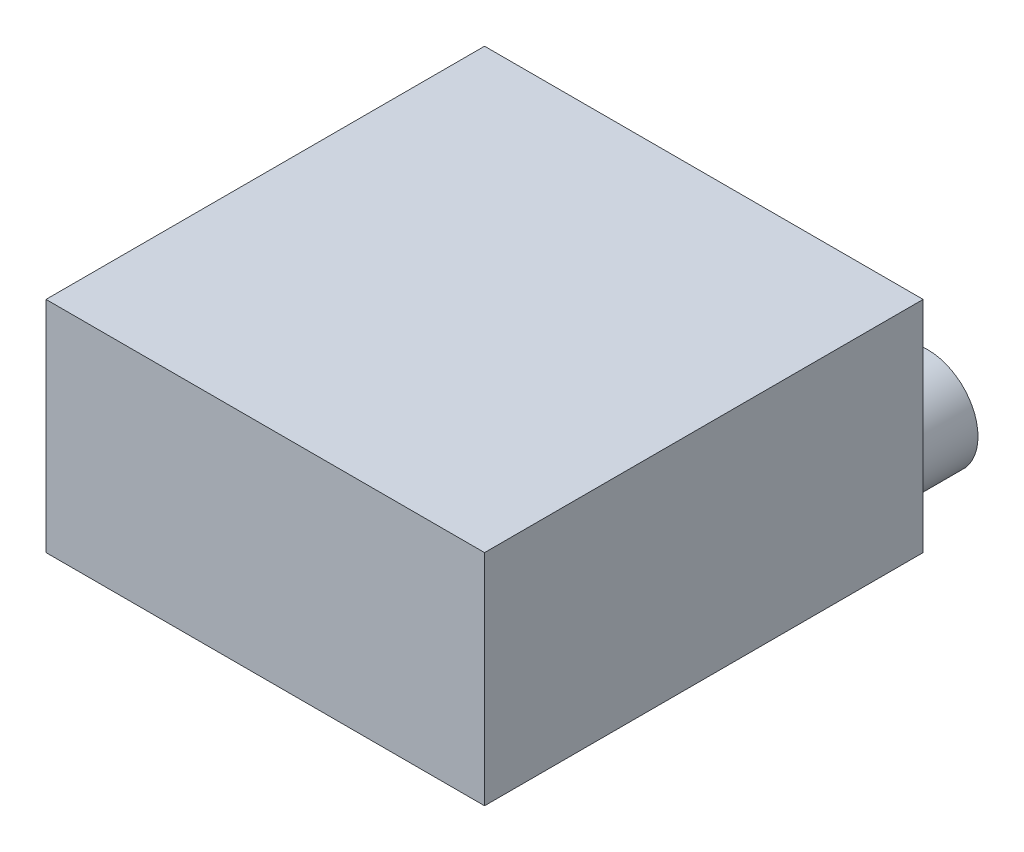
ISO-10303-21;
HEADER;
FILE_DESCRIPTION(('STEP AP214'),'2;1');
FILE_NAME('part.step','',(''),(''),'','','');
FILE_SCHEMA(('AUTOMOTIVE_DESIGN { 1 0 10303 214 1 1 1 1 }'));
ENDSEC;
DATA;
#1=APPLICATION_CONTEXT('core data for automotive mechanical design processes');
#2=APPLICATION_PROTOCOL_DEFINITION('international standard','automotive_design',2000,#1);
#3=PRODUCT_CONTEXT('',#1,'mechanical');
#4=PRODUCT('Part','Part','',(#3));
#5=PRODUCT_RELATED_PRODUCT_CATEGORY('part','',(#4));
#6=PRODUCT_DEFINITION_FORMATION('','',#4);
#7=PRODUCT_DEFINITION_CONTEXT('part definition',#1,'design');
#8=PRODUCT_DEFINITION('design','',#6,#7);
#9=PRODUCT_DEFINITION_SHAPE('','',#8);
#10=(LENGTH_UNIT() NAMED_UNIT(*) SI_UNIT(.MILLI.,.METRE.));
#11=(NAMED_UNIT(*) PLANE_ANGLE_UNIT() SI_UNIT($,.RADIAN.));
#12=(NAMED_UNIT(*) SI_UNIT($,.STERADIAN.) SOLID_ANGLE_UNIT());
#13=UNCERTAINTY_MEASURE_WITH_UNIT(LENGTH_MEASURE(1.E-05),#10,'distance_accuracy_value','');
#14=(GEOMETRIC_REPRESENTATION_CONTEXT(3) GLOBAL_UNCERTAINTY_ASSIGNED_CONTEXT((#13)) GLOBAL_UNIT_ASSIGNED_CONTEXT((#10,
#11,#12)) REPRESENTATION_CONTEXT('',''));
#15=CARTESIAN_POINT('',(0.,0.,0.));
#16=DIRECTION('',(0.,0.,1.));
#17=DIRECTION('',(1.,0.,0.));
#18=AXIS2_PLACEMENT_3D('',#15,#16,#17);
#19=CARTESIAN_POINT('',(-4.69849246231156,5.,-0.653266331658294));
#20=DIRECTION('',(1.,0.,0.));
#21=DIRECTION('',(0.,0.,-1.));
#22=AXIS2_PLACEMENT_3D('',#19,#20,#21);
#23=PLANE('',#22);
#24=DIRECTION('',(0.,0.,1.));
#25=VECTOR('',#24,1.);
#26=CARTESIAN_POINT('',(-4.69849246231156,0.,-0.653266331658294));
#27=LINE('',#26,#25);
#28=CARTESIAN_POINT('',(-4.69849246231156,0.,-0.653266331658294));
#29=VERTEX_POINT('',#28);
#30=CARTESIAN_POINT('',(-4.69849246231155,0.,9.34673366834171));
#31=VERTEX_POINT('',#30);
#32=EDGE_CURVE('E99',#29,#31,#27,.T.);
#33=ORIENTED_EDGE('',*,*,#32,.T.);
#34=DIRECTION('',(0.,-1.,0.));
#35=VECTOR('',#34,1.);
#36=CARTESIAN_POINT('',(-4.69849246231155,5.,9.34673366834171));
#37=LINE('',#36,#35);
#38=CARTESIAN_POINT('',(-4.69849246231155,5.,9.34673366834171));
#39=VERTEX_POINT('',#38);
#40=EDGE_CURVE('E41',#39,#31,#37,.T.);
#41=ORIENTED_EDGE('',*,*,#40,.F.);
#42=DIRECTION('',(0.,0.,1.));
#43=VECTOR('',#42,1.);
#44=CARTESIAN_POINT('',(-4.69849246231156,5.,-0.653266331658294));
#45=LINE('',#44,#43);
#46=CARTESIAN_POINT('',(-4.69849246231156,5.,-0.653266331658294));
#47=VERTEX_POINT('',#46);
#48=EDGE_CURVE('E85',#47,#39,#45,.T.);
#49=ORIENTED_EDGE('',*,*,#48,.F.);
#50=DIRECTION('',(0.,-1.,0.));
#51=VECTOR('',#50,1.);
#52=CARTESIAN_POINT('',(-4.69849246231156,5.,-0.653266331658294));
#53=LINE('',#52,#51);
#54=EDGE_CURVE('E95',#47,#29,#53,.T.);
#55=ORIENTED_EDGE('',*,*,#54,.T.);
#56=EDGE_LOOP('',(#33,#41,#49,#55));
#57=FACE_BOUND('',#56,.T.);
#58=ADVANCED_FACE('F33',(#57),#23,.F.);
#59=CARTESIAN_POINT('',(-4.69849246231155,5.,9.34673366834171));
#60=DIRECTION('',(0.,0.,-1.));
#61=DIRECTION('',(-1.,0.,0.));
#62=AXIS2_PLACEMENT_3D('',#59,#60,#61);
#63=PLANE('',#62);
#64=DIRECTION('',(1.,0.,0.));
#65=VECTOR('',#64,1.);
#66=CARTESIAN_POINT('',(-4.69849246231155,0.,9.34673366834171));
#67=LINE('',#66,#65);
#68=CARTESIAN_POINT('',(5.30150753768844,0.,9.34673366834171));
#69=VERTEX_POINT('',#68);
#70=EDGE_CURVE('E90',#31,#69,#67,.T.);
#71=ORIENTED_EDGE('',*,*,#70,.T.);
#72=DIRECTION('',(0.,-1.,0.));
#73=VECTOR('',#72,1.);
#74=CARTESIAN_POINT('',(5.30150753768844,5.,9.34673366834171));
#75=LINE('',#74,#73);
#76=CARTESIAN_POINT('',(5.30150753768844,5.,9.34673366834171));
#77=VERTEX_POINT('',#76);
#78=EDGE_CURVE('E88',#77,#69,#75,.T.);
#79=ORIENTED_EDGE('',*,*,#78,.F.);
#80=DIRECTION('',(1.,0.,0.));
#81=VECTOR('',#80,1.);
#82=CARTESIAN_POINT('',(-4.69849246231155,5.,9.34673366834171));
#83=LINE('',#82,#81);
#84=EDGE_CURVE('E80',#39,#77,#83,.T.);
#85=ORIENTED_EDGE('',*,*,#84,.F.);
#86=ORIENTED_EDGE('',*,*,#40,.T.);
#87=EDGE_LOOP('',(#71,#79,#85,#86));
#88=FACE_BOUND('',#87,.T.);
#89=ADVANCED_FACE('F89',(#88),#63,.F.);
#90=CARTESIAN_POINT('',(5.30150753768844,5.,-0.653266331658294));
#91=DIRECTION('',(-1.,0.,0.));
#92=DIRECTION('',(0.,0.,1.));
#93=AXIS2_PLACEMENT_3D('',#90,#91,#92);
#94=PLANE('',#93);
#95=DIRECTION('',(0.,0.,-1.));
#96=VECTOR('',#95,1.);
#97=CARTESIAN_POINT('',(5.30150753768844,0.,-0.653266331658294));
#98=LINE('',#97,#96);
#99=CARTESIAN_POINT('',(5.30150753768844,0.,-0.653266331658294));
#100=VERTEX_POINT('',#99);
#101=EDGE_CURVE('E66',#69,#100,#98,.T.);
#102=ORIENTED_EDGE('',*,*,#101,.T.);
#103=DIRECTION('',(0.,-1.,0.));
#104=VECTOR('',#103,1.);
#105=CARTESIAN_POINT('',(5.30150753768844,5.,-0.653266331658294));
#106=LINE('',#105,#104);
#107=CARTESIAN_POINT('',(5.30150753768844,5.,-0.653266331658294));
#108=VERTEX_POINT('',#107);
#109=EDGE_CURVE('E91',#108,#100,#106,.T.);
#110=ORIENTED_EDGE('',*,*,#109,.F.);
#111=DIRECTION('',(0.,0.,-1.));
#112=VECTOR('',#111,1.);
#113=CARTESIAN_POINT('',(5.30150753768844,5.,-0.653266331658294));
#114=LINE('',#113,#112);
#115=EDGE_CURVE('E83',#77,#108,#114,.T.);
#116=ORIENTED_EDGE('',*,*,#115,.F.);
#117=ORIENTED_EDGE('',*,*,#78,.T.);
#118=EDGE_LOOP('',(#102,#110,#116,#117));
#119=FACE_BOUND('',#118,.T.);
#120=ADVANCED_FACE('F93',(#119),#94,.F.);
#121=CARTESIAN_POINT('',(-4.69849246231156,5.,-0.653266331658294));
#122=DIRECTION('',(0.,0.,1.));
#123=DIRECTION('',(1.,0.,0.));
#124=AXIS2_PLACEMENT_3D('',#121,#122,#123);
#125=PLANE('',#124);
#126=CARTESIAN_POINT('',(3.90937804929714,1.41640749139401,-0.653266331658294));
#127=DIRECTION('',(0.,0.,1.));
#128=DIRECTION('',(1.,0.,0.));
#129=AXIS2_PLACEMENT_3D('',#126,#127,#128);
#130=CIRCLE('',#129,1.14344508698068);
#131=CARTESIAN_POINT('',(5.05282313627782,1.41640749139401,-0.653266331658294));
#132=VERTEX_POINT('',#131);
#133=EDGE_CURVE('E11',#132,#132,#130,.F.);
#134=ORIENTED_EDGE('',*,*,#133,.F.);
#135=EDGE_LOOP('',(#134));
#136=FACE_BOUND('',#135,.T.);
#137=DIRECTION('',(-1.,0.,0.));
#138=VECTOR('',#137,1.);
#139=CARTESIAN_POINT('',(-4.69849246231156,0.,-0.653266331658294));
#140=LINE('',#139,#138);
#141=EDGE_CURVE('E72',#100,#29,#140,.T.);
#142=ORIENTED_EDGE('',*,*,#141,.T.);
#143=ORIENTED_EDGE('',*,*,#54,.F.);
#144=DIRECTION('',(-1.,0.,0.));
#145=VECTOR('',#144,1.);
#146=CARTESIAN_POINT('',(-4.69849246231156,5.,-0.653266331658294));
#147=LINE('',#146,#145);
#148=EDGE_CURVE('E49',#108,#47,#147,.T.);
#149=ORIENTED_EDGE('',*,*,#148,.F.);
#150=ORIENTED_EDGE('',*,*,#109,.T.);
#151=EDGE_LOOP('',(#142,#143,#149,#150));
#152=FACE_BOUND('',#151,.T.);
#153=ADVANCED_FACE('F121',(#136,#152),#125,.F.);
#154=CARTESIAN_POINT('',(0.,5.,0.));
#155=DIRECTION('',(0.,1.,0.));
#156=DIRECTION('',(0.,0.,1.));
#157=AXIS2_PLACEMENT_3D('',#154,#155,#156);
#158=PLANE('',#157);
#159=ORIENTED_EDGE('',*,*,#48,.T.);
#160=ORIENTED_EDGE('',*,*,#84,.T.);
#161=ORIENTED_EDGE('',*,*,#115,.T.);
#162=ORIENTED_EDGE('',*,*,#148,.T.);
#163=EDGE_LOOP('',(#159,#160,#161,#162));
#164=FACE_BOUND('',#163,.T.);
#165=ADVANCED_FACE('F81',(#164),#158,.T.);
#166=CARTESIAN_POINT('',(0.,0.,0.));
#167=DIRECTION('',(0.,1.,0.));
#168=DIRECTION('',(0.,0.,1.));
#169=AXIS2_PLACEMENT_3D('',#166,#167,#168);
#170=PLANE('',#169);
#171=ORIENTED_EDGE('',*,*,#32,.F.);
#172=ORIENTED_EDGE('',*,*,#141,.F.);
#173=ORIENTED_EDGE('',*,*,#101,.F.);
#174=ORIENTED_EDGE('',*,*,#70,.F.);
#175=EDGE_LOOP('',(#171,#172,#173,#174));
#176=FACE_BOUND('',#175,.T.);
#177=ADVANCED_FACE('F110',(#176),#170,.F.);
#178=CARTESIAN_POINT('',(3.90937804929714,1.41640749139401,-2.15326633165829));
#179=DIRECTION('',(0.,0.,1.));
#180=DIRECTION('',(1.,0.,0.));
#181=AXIS2_PLACEMENT_3D('',#178,#179,#180);
#182=CYLINDRICAL_SURFACE('',#181,1.14344508698068);
#183=CARTESIAN_POINT('',(3.90937804929714,1.41640749139401,-2.15326633165829));
#184=DIRECTION('',(0.,0.,-1.));
#185=DIRECTION('',(-1.,0.,0.));
#186=AXIS2_PLACEMENT_3D('',#183,#184,#185);
#187=CIRCLE('',#186,1.14344508698068);
#188=CARTESIAN_POINT('',(2.76593296231646,1.41640749139401,-2.15326633165829));
#189=VERTEX_POINT('',#188);
#190=EDGE_CURVE('E102',#189,#189,#187,.T.);
#191=ORIENTED_EDGE('',*,*,#190,.F.);
#192=EDGE_LOOP('',(#191));
#193=FACE_BOUND('',#192,.T.);
#194=ORIENTED_EDGE('',*,*,#133,.T.);
#195=EDGE_LOOP('',(#194));
#196=FACE_BOUND('',#195,.T.);
#197=ADVANCED_FACE('F112',(#193,#196),#182,.T.);
#198=CARTESIAN_POINT('',(3.90937804929714,1.41640749139401,-2.15326633165829));
#199=DIRECTION('',(0.,0.,-1.));
#200=DIRECTION('',(-1.,0.,0.));
#201=AXIS2_PLACEMENT_3D('',#198,#199,#200);
#202=PLANE('',#201);
#203=ORIENTED_EDGE('',*,*,#190,.T.);
#204=EDGE_LOOP('',(#203));
#205=FACE_BOUND('',#204,.T.);
#206=ADVANCED_FACE('F118',(#205),#202,.T.);
#207=CLOSED_SHELL('',(#58,#89,#120,#153,#165,#177,#197,#206));
#208=MANIFOLD_SOLID_BREP('B2',#207);
#209=ADVANCED_BREP_SHAPE_REPRESENTATION('',(#18,#208),#14);
#210=SHAPE_DEFINITION_REPRESENTATION(#9,#209);
ENDSEC;
END-ISO-10303-21;
